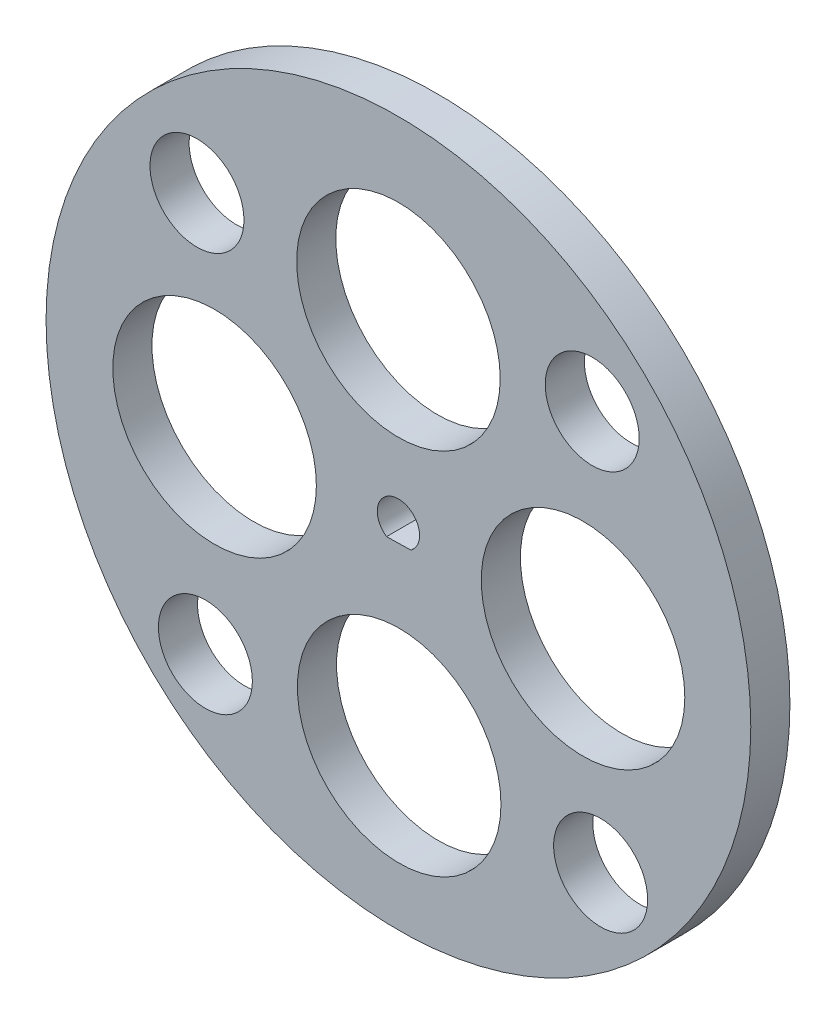
ISO-10303-21;
HEADER;
FILE_DESCRIPTION(('STEP AP214'),'2;1');
FILE_NAME('part.step','',(''),(''),'','','');
FILE_SCHEMA(('AUTOMOTIVE_DESIGN { 1 0 10303 214 1 1 1 1 }'));
ENDSEC;
DATA;
#1=APPLICATION_CONTEXT('core data for automotive mechanical design processes');
#2=APPLICATION_PROTOCOL_DEFINITION('international standard','automotive_design',2000,#1);
#3=PRODUCT_CONTEXT('',#1,'mechanical');
#4=PRODUCT('Part','Part','',(#3));
#5=PRODUCT_RELATED_PRODUCT_CATEGORY('part','',(#4));
#6=PRODUCT_DEFINITION_FORMATION('','',#4);
#7=PRODUCT_DEFINITION_CONTEXT('part definition',#1,'design');
#8=PRODUCT_DEFINITION('design','',#6,#7);
#9=PRODUCT_DEFINITION_SHAPE('','',#8);
#10=(LENGTH_UNIT() NAMED_UNIT(*) SI_UNIT(.MILLI.,.METRE.));
#11=(NAMED_UNIT(*) PLANE_ANGLE_UNIT() SI_UNIT($,.RADIAN.));
#12=(NAMED_UNIT(*) SI_UNIT($,.STERADIAN.) SOLID_ANGLE_UNIT());
#13=UNCERTAINTY_MEASURE_WITH_UNIT(LENGTH_MEASURE(1.E-05),#10,'distance_accuracy_value','');
#14=(GEOMETRIC_REPRESENTATION_CONTEXT(3) GLOBAL_UNCERTAINTY_ASSIGNED_CONTEXT((#13)) GLOBAL_UNIT_ASSIGNED_CONTEXT((#10,
#11,#12)) REPRESENTATION_CONTEXT('',''));
#15=CARTESIAN_POINT('',(0.,0.,0.));
#16=DIRECTION('',(0.,0.,1.));
#17=DIRECTION('',(1.,0.,0.));
#18=AXIS2_PLACEMENT_3D('',#15,#16,#17);
#19=CARTESIAN_POINT('',(-0.0477356811711086,1.02658753548092,5.));
#20=DIRECTION('',(0.,0.,1.));
#21=DIRECTION('',(1.,0.,0.));
#22=AXIS2_PLACEMENT_3D('',#19,#20,#21);
#23=PLANE('',#22);
#24=CARTESIAN_POINT('',(-24.7010016603567,-25.7753248770113,5.));
#25=DIRECTION('',(0.,0.,1.));
#26=DIRECTION('',(1.,0.,0.));
#27=AXIS2_PLACEMENT_3D('',#24,#25,#26);
#28=CIRCLE('',#27,6.00000000000113);
#29=CARTESIAN_POINT('',(-18.7010016603556,-25.7753248770113,5.));
#30=VERTEX_POINT('',#29);
#31=EDGE_CURVE('E113',#30,#30,#28,.T.);
#32=ORIENTED_EDGE('',*,*,#31,.F.);
#33=EDGE_LOOP('',(#32));
#34=FACE_BOUND('',#33,.T.);
#35=CARTESIAN_POINT('',(-23.5265875354803,-0.0477356811717486,5.));
#36=DIRECTION('',(0.,0.,1.));
#37=DIRECTION('',(1.,0.,0.));
#38=AXIS2_PLACEMENT_3D('',#35,#36,#37);
#39=CIRCLE('',#38,13.);
#40=CARTESIAN_POINT('',(-10.5265875354803,-0.0477356811717486,5.));
#41=VERTEX_POINT('',#40);
#42=EDGE_CURVE('E101',#41,#41,#39,.T.);
#43=ORIENTED_EDGE('',*,*,#42,.F.);
#44=EDGE_LOOP('',(#43));
#45=FACE_BOUND('',#44,.T.);
#46=CARTESIAN_POINT('',(23.5265875354816,0.0477356811717458,5.));
#47=DIRECTION('',(0.,0.,1.));
#48=DIRECTION('',(1.,0.,0.));
#49=AXIS2_PLACEMENT_3D('',#46,#47,#48);
#50=CIRCLE('',#49,13.);
#51=CARTESIAN_POINT('',(36.5265875354815,0.0477356811717458,5.));
#52=VERTEX_POINT('',#51);
#53=EDGE_CURVE('E89',#52,#52,#50,.T.);
#54=ORIENTED_EDGE('',*,*,#53,.F.);
#55=EDGE_LOOP('',(#54));
#56=FACE_BOUND('',#55,.T.);
#57=CARTESIAN_POINT('',(-0.047735681171109,23.5265875354809,5.));
#58=DIRECTION('',(0.,0.,1.));
#59=DIRECTION('',(1.,0.,0.));
#60=AXIS2_PLACEMENT_3D('',#57,#58,#59);
#61=CIRCLE('',#60,13.);
#62=CARTESIAN_POINT('',(12.9522643188289,23.5265875354809,5.));
#63=VERTEX_POINT('',#62);
#64=EDGE_CURVE('E73',#63,#63,#61,.T.);
#65=ORIENTED_EDGE('',*,*,#64,.F.);
#66=EDGE_LOOP('',(#65));
#67=FACE_BOUND('',#66,.T.);
#68=CARTESIAN_POINT('',(-0.0477356811711086,1.02658753548092,5.));
#69=DIRECTION('',(0.,0.,1.));
#70=DIRECTION('',(1.,0.,0.));
#71=AXIS2_PLACEMENT_3D('',#68,#69,#70);
#72=CIRCLE('',#71,45.);
#73=CARTESIAN_POINT('',(44.9522643188289,1.02658753548092,5.));
#74=VERTEX_POINT('',#73);
#75=EDGE_CURVE('E11',#74,#74,#72,.T.);
#76=ORIENTED_EDGE('',*,*,#75,.T.);
#77=EDGE_LOOP('',(#76));
#78=FACE_BOUND('',#77,.T.);
#79=DIRECTION('',(0.999777310071625,0.0211028497114699,0.));
#80=VECTOR('',#79,1.);
#81=CARTESIAN_POINT('',(-1.56595718523754,-1.20612459656617,5.));
#82=LINE('',#81,#80);
#83=CARTESIAN_POINT('',(-1.56595718523754,-1.20612459656617,5.));
#84=VERTEX_POINT('',#83);
#85=CARTESIAN_POINT('',(1.56334579528665,-1.14007267696927,5.));
#86=VERTEX_POINT('',#85);
#87=EDGE_CURVE('E79',#84,#86,#82,.T.);
#88=ORIENTED_EDGE('',*,*,#87,.F.);
#89=CARTESIAN_POINT('',(-0.0477356811711086,1.02658753548092,5.));
#90=DIRECTION('',(0.,0.,1.));
#91=DIRECTION('',(1.,0.,0.));
#92=AXIS2_PLACEMENT_3D('',#89,#90,#91);
#93=CIRCLE('',#92,2.7);
#94=EDGE_CURVE('E65',#86,#84,#93,.T.);
#95=ORIENTED_EDGE('',*,*,#94,.F.);
#96=EDGE_LOOP('',(#88,#95));
#97=FACE_BOUND('',#96,.T.);
#98=CARTESIAN_POINT('',(24.7010016603582,25.77532487701,5.));
#99=DIRECTION('',(0.,0.,1.));
#100=DIRECTION('',(1.,0.,0.));
#101=AXIS2_PLACEMENT_3D('',#98,#99,#100);
#102=CIRCLE('',#101,6.00000000000113);
#103=CARTESIAN_POINT('',(30.7010016603593,25.77532487701,5.));
#104=VERTEX_POINT('',#103);
#105=EDGE_CURVE('E84',#104,#104,#102,.T.);
#106=ORIENTED_EDGE('',*,*,#105,.F.);
#107=EDGE_LOOP('',(#106));
#108=FACE_BOUND('',#107,.T.);
#109=CARTESIAN_POINT('',(0.0477356811723826,-23.5265875354809,5.));
#110=DIRECTION('',(0.,0.,1.));
#111=DIRECTION('',(1.,0.,0.));
#112=AXIS2_PLACEMENT_3D('',#109,#110,#111);
#113=CIRCLE('',#112,13.);
#114=CARTESIAN_POINT('',(13.0477356811724,-23.5265875354809,5.));
#115=VERTEX_POINT('',#114);
#116=EDGE_CURVE('E95',#115,#115,#113,.T.);
#117=ORIENTED_EDGE('',*,*,#116,.F.);
#118=EDGE_LOOP('',(#117));
#119=FACE_BOUND('',#118,.T.);
#120=CARTESIAN_POINT('',(25.7753248770113,-24.7010016603581,5.));
#121=DIRECTION('',(0.,0.,1.));
#122=DIRECTION('',(1.,0.,0.));
#123=AXIS2_PLACEMENT_3D('',#120,#121,#122);
#124=CIRCLE('',#123,6.00000000000113);
#125=CARTESIAN_POINT('',(31.7753248770125,-24.7010016603581,5.));
#126=VERTEX_POINT('',#125);
#127=EDGE_CURVE('E107',#126,#126,#124,.T.);
#128=ORIENTED_EDGE('',*,*,#127,.F.);
#129=EDGE_LOOP('',(#128));
#130=FACE_BOUND('',#129,.T.);
#131=CARTESIAN_POINT('',(-25.7753248770099,24.7010016603568,5.));
#132=DIRECTION('',(0.,0.,1.));
#133=DIRECTION('',(1.,0.,0.));
#134=AXIS2_PLACEMENT_3D('',#131,#132,#133);
#135=CIRCLE('',#134,6.00000000000113);
#136=CARTESIAN_POINT('',(-19.7753248770087,24.7010016603568,5.));
#137=VERTEX_POINT('',#136);
#138=EDGE_CURVE('E119',#137,#137,#135,.T.);
#139=ORIENTED_EDGE('',*,*,#138,.F.);
#140=EDGE_LOOP('',(#139));
#141=FACE_BOUND('',#140,.T.);
#142=ADVANCED_FACE('F33',(#34,#45,#56,#67,#78,#97,#108,#119,#130,#141),#23,.T.);
#143=CARTESIAN_POINT('',(-0.0477356811711086,1.02658753548092,0.));
#144=DIRECTION('',(0.,0.,1.));
#145=DIRECTION('',(1.,0.,0.));
#146=AXIS2_PLACEMENT_3D('',#143,#144,#145);
#147=PLANE('',#146);
#148=CARTESIAN_POINT('',(-0.0477356811711086,1.02658753548092,0.));
#149=DIRECTION('',(0.,0.,1.));
#150=DIRECTION('',(1.,0.,0.));
#151=AXIS2_PLACEMENT_3D('',#148,#149,#150);
#152=CIRCLE('',#151,45.);
#153=CARTESIAN_POINT('',(44.9522643188289,1.02658753548092,0.));
#154=VERTEX_POINT('',#153);
#155=EDGE_CURVE('E37',#154,#154,#152,.T.);
#156=ORIENTED_EDGE('',*,*,#155,.F.);
#157=EDGE_LOOP('',(#156));
#158=FACE_BOUND('',#157,.T.);
#159=CARTESIAN_POINT('',(-0.0477356811711086,1.02658753548092,0.));
#160=DIRECTION('',(0.,0.,1.));
#161=DIRECTION('',(1.,0.,0.));
#162=AXIS2_PLACEMENT_3D('',#159,#160,#161);
#163=CIRCLE('',#162,2.7);
#164=CARTESIAN_POINT('',(1.56334579528665,-1.14007267696927,0.));
#165=VERTEX_POINT('',#164);
#166=CARTESIAN_POINT('',(-1.56595718523754,-1.20612459656617,0.));
#167=VERTEX_POINT('',#166);
#168=EDGE_CURVE('E55',#165,#167,#163,.T.);
#169=ORIENTED_EDGE('',*,*,#168,.T.);
#170=DIRECTION('',(0.999777310071625,0.0211028497114699,0.));
#171=VECTOR('',#170,1.);
#172=CARTESIAN_POINT('',(-1.56595718523754,-1.20612459656617,0.));
#173=LINE('',#172,#171);
#174=EDGE_CURVE('E61',#167,#165,#173,.T.);
#175=ORIENTED_EDGE('',*,*,#174,.T.);
#176=EDGE_LOOP('',(#169,#175));
#177=FACE_BOUND('',#176,.T.);
#178=CARTESIAN_POINT('',(-0.047735681171109,23.5265875354809,0.));
#179=DIRECTION('',(0.,0.,1.));
#180=DIRECTION('',(1.,0.,0.));
#181=AXIS2_PLACEMENT_3D('',#178,#179,#180);
#182=CIRCLE('',#181,13.);
#183=CARTESIAN_POINT('',(12.9522643188289,23.5265875354809,0.));
#184=VERTEX_POINT('',#183);
#185=EDGE_CURVE('E76',#184,#184,#182,.T.);
#186=ORIENTED_EDGE('',*,*,#185,.T.);
#187=EDGE_LOOP('',(#186));
#188=FACE_BOUND('',#187,.T.);
#189=CARTESIAN_POINT('',(24.7010016603582,25.77532487701,0.));
#190=DIRECTION('',(0.,0.,1.));
#191=DIRECTION('',(1.,0.,0.));
#192=AXIS2_PLACEMENT_3D('',#189,#190,#191);
#193=CIRCLE('',#192,6.00000000000113);
#194=CARTESIAN_POINT('',(30.7010016603593,25.77532487701,0.));
#195=VERTEX_POINT('',#194);
#196=EDGE_CURVE('E86',#195,#195,#193,.T.);
#197=ORIENTED_EDGE('',*,*,#196,.T.);
#198=EDGE_LOOP('',(#197));
#199=FACE_BOUND('',#198,.T.);
#200=CARTESIAN_POINT('',(23.5265875354816,0.0477356811717458,0.));
#201=DIRECTION('',(0.,0.,1.));
#202=DIRECTION('',(1.,0.,0.));
#203=AXIS2_PLACEMENT_3D('',#200,#201,#202);
#204=CIRCLE('',#203,13.);
#205=CARTESIAN_POINT('',(36.5265875354815,0.0477356811717458,0.));
#206=VERTEX_POINT('',#205);
#207=EDGE_CURVE('E92',#206,#206,#204,.T.);
#208=ORIENTED_EDGE('',*,*,#207,.T.);
#209=EDGE_LOOP('',(#208));
#210=FACE_BOUND('',#209,.T.);
#211=CARTESIAN_POINT('',(0.0477356811723826,-23.5265875354809,0.));
#212=DIRECTION('',(0.,0.,1.));
#213=DIRECTION('',(1.,0.,0.));
#214=AXIS2_PLACEMENT_3D('',#211,#212,#213);
#215=CIRCLE('',#214,13.);
#216=CARTESIAN_POINT('',(13.0477356811724,-23.5265875354809,0.));
#217=VERTEX_POINT('',#216);
#218=EDGE_CURVE('E98',#217,#217,#215,.T.);
#219=ORIENTED_EDGE('',*,*,#218,.T.);
#220=EDGE_LOOP('',(#219));
#221=FACE_BOUND('',#220,.T.);
#222=CARTESIAN_POINT('',(-23.5265875354803,-0.0477356811717486,0.));
#223=DIRECTION('',(0.,0.,1.));
#224=DIRECTION('',(1.,0.,0.));
#225=AXIS2_PLACEMENT_3D('',#222,#223,#224);
#226=CIRCLE('',#225,13.);
#227=CARTESIAN_POINT('',(-10.5265875354803,-0.0477356811717486,0.));
#228=VERTEX_POINT('',#227);
#229=EDGE_CURVE('E104',#228,#228,#226,.T.);
#230=ORIENTED_EDGE('',*,*,#229,.T.);
#231=EDGE_LOOP('',(#230));
#232=FACE_BOUND('',#231,.T.);
#233=CARTESIAN_POINT('',(25.7753248770113,-24.7010016603581,0.));
#234=DIRECTION('',(0.,0.,1.));
#235=DIRECTION('',(1.,0.,0.));
#236=AXIS2_PLACEMENT_3D('',#233,#234,#235);
#237=CIRCLE('',#236,6.00000000000113);
#238=CARTESIAN_POINT('',(31.7753248770125,-24.7010016603581,0.));
#239=VERTEX_POINT('',#238);
#240=EDGE_CURVE('E110',#239,#239,#237,.T.);
#241=ORIENTED_EDGE('',*,*,#240,.T.);
#242=EDGE_LOOP('',(#241));
#243=FACE_BOUND('',#242,.T.);
#244=CARTESIAN_POINT('',(-24.7010016603567,-25.7753248770113,0.));
#245=DIRECTION('',(0.,0.,1.));
#246=DIRECTION('',(1.,0.,0.));
#247=AXIS2_PLACEMENT_3D('',#244,#245,#246);
#248=CIRCLE('',#247,6.00000000000113);
#249=CARTESIAN_POINT('',(-18.7010016603556,-25.7753248770113,0.));
#250=VERTEX_POINT('',#249);
#251=EDGE_CURVE('E116',#250,#250,#248,.T.);
#252=ORIENTED_EDGE('',*,*,#251,.T.);
#253=EDGE_LOOP('',(#252));
#254=FACE_BOUND('',#253,.T.);
#255=CARTESIAN_POINT('',(-25.7753248770099,24.7010016603568,0.));
#256=DIRECTION('',(0.,0.,1.));
#257=DIRECTION('',(1.,0.,0.));
#258=AXIS2_PLACEMENT_3D('',#255,#256,#257);
#259=CIRCLE('',#258,6.00000000000113);
#260=CARTESIAN_POINT('',(-19.7753248770087,24.7010016603568,0.));
#261=VERTEX_POINT('',#260);
#262=EDGE_CURVE('E122',#261,#261,#259,.T.);
#263=ORIENTED_EDGE('',*,*,#262,.T.);
#264=EDGE_LOOP('',(#263));
#265=FACE_BOUND('',#264,.T.);
#266=ADVANCED_FACE('F71',(#158,#177,#188,#199,#210,#221,#232,#243,#254,#265),#147,.F.);
#267=CARTESIAN_POINT('',(-0.0477356811711086,1.02658753548092,5.));
#268=DIRECTION('',(0.,0.,-1.));
#269=DIRECTION('',(-1.,0.,0.));
#270=AXIS2_PLACEMENT_3D('',#267,#268,#269);
#271=CYLINDRICAL_SURFACE('',#270,45.);
#272=ORIENTED_EDGE('',*,*,#75,.F.);
#273=EDGE_LOOP('',(#272));
#274=FACE_BOUND('',#273,.T.);
#275=ORIENTED_EDGE('',*,*,#155,.T.);
#276=EDGE_LOOP('',(#275));
#277=FACE_BOUND('',#276,.T.);
#278=ADVANCED_FACE('F35',(#274,#277),#271,.T.);
#279=CARTESIAN_POINT('',(-0.0477356811711086,1.02658753548092,5.));
#280=DIRECTION('',(0.,0.,-1.));
#281=DIRECTION('',(-1.,0.,0.));
#282=AXIS2_PLACEMENT_3D('',#279,#280,#281);
#283=CYLINDRICAL_SURFACE('',#282,2.7);
#284=ORIENTED_EDGE('',*,*,#168,.F.);
#285=DIRECTION('',(0.,0.,-1.));
#286=VECTOR('',#285,1.);
#287=CARTESIAN_POINT('',(1.56334579528665,-1.14007267696927,5.));
#288=LINE('',#287,#286);
#289=EDGE_CURVE('E63',#86,#165,#288,.T.);
#290=ORIENTED_EDGE('',*,*,#289,.F.);
#291=ORIENTED_EDGE('',*,*,#94,.T.);
#292=DIRECTION('',(0.,0.,-1.));
#293=VECTOR('',#292,1.);
#294=CARTESIAN_POINT('',(-1.56595718523754,-1.20612459656617,5.));
#295=LINE('',#294,#293);
#296=EDGE_CURVE('E48',#84,#167,#295,.T.);
#297=ORIENTED_EDGE('',*,*,#296,.T.);
#298=EDGE_LOOP('',(#284,#290,#291,#297));
#299=FACE_BOUND('',#298,.T.);
#300=ADVANCED_FACE('F67',(#299),#283,.F.);
#301=CARTESIAN_POINT('',(-1.56595718523754,-1.20612459656617,5.));
#302=DIRECTION('',(-0.0211028497114699,0.999777310071625,0.));
#303=DIRECTION('',(-0.999777310071626,-0.0211028497114699,0.));
#304=AXIS2_PLACEMENT_3D('',#301,#302,#303);
#305=PLANE('',#304);
#306=ORIENTED_EDGE('',*,*,#174,.F.);
#307=ORIENTED_EDGE('',*,*,#296,.F.);
#308=ORIENTED_EDGE('',*,*,#87,.T.);
#309=ORIENTED_EDGE('',*,*,#289,.T.);
#310=EDGE_LOOP('',(#306,#307,#308,#309));
#311=FACE_BOUND('',#310,.T.);
#312=ADVANCED_FACE('F62',(#311),#305,.T.);
#313=CARTESIAN_POINT('',(-0.047735681171109,23.5265875354809,5.));
#314=DIRECTION('',(0.,0.,-1.));
#315=DIRECTION('',(-1.,0.,0.));
#316=AXIS2_PLACEMENT_3D('',#313,#314,#315);
#317=CYLINDRICAL_SURFACE('',#316,13.);
#318=ORIENTED_EDGE('',*,*,#64,.T.);
#319=EDGE_LOOP('',(#318));
#320=FACE_BOUND('',#319,.T.);
#321=ORIENTED_EDGE('',*,*,#185,.F.);
#322=EDGE_LOOP('',(#321));
#323=FACE_BOUND('',#322,.T.);
#324=ADVANCED_FACE('F145',(#320,#323),#317,.F.);
#325=CARTESIAN_POINT('',(24.7010016603582,25.77532487701,5.));
#326=DIRECTION('',(0.,0.,-1.));
#327=DIRECTION('',(-1.,0.,0.));
#328=AXIS2_PLACEMENT_3D('',#325,#326,#327);
#329=CYLINDRICAL_SURFACE('',#328,6.00000000000113);
#330=ORIENTED_EDGE('',*,*,#105,.T.);
#331=EDGE_LOOP('',(#330));
#332=FACE_BOUND('',#331,.T.);
#333=ORIENTED_EDGE('',*,*,#196,.F.);
#334=EDGE_LOOP('',(#333));
#335=FACE_BOUND('',#334,.T.);
#336=ADVANCED_FACE('F148',(#332,#335),#329,.F.);
#337=CARTESIAN_POINT('',(23.5265875354816,0.0477356811717458,5.));
#338=DIRECTION('',(0.,0.,-1.));
#339=DIRECTION('',(-1.,0.,0.));
#340=AXIS2_PLACEMENT_3D('',#337,#338,#339);
#341=CYLINDRICAL_SURFACE('',#340,13.);
#342=ORIENTED_EDGE('',*,*,#53,.T.);
#343=EDGE_LOOP('',(#342));
#344=FACE_BOUND('',#343,.T.);
#345=ORIENTED_EDGE('',*,*,#207,.F.);
#346=EDGE_LOOP('',(#345));
#347=FACE_BOUND('',#346,.T.);
#348=ADVANCED_FACE('F152',(#344,#347),#341,.F.);
#349=CARTESIAN_POINT('',(0.0477356811723826,-23.5265875354809,5.));
#350=DIRECTION('',(0.,0.,-1.));
#351=DIRECTION('',(-1.,0.,0.));
#352=AXIS2_PLACEMENT_3D('',#349,#350,#351);
#353=CYLINDRICAL_SURFACE('',#352,13.);
#354=ORIENTED_EDGE('',*,*,#116,.T.);
#355=EDGE_LOOP('',(#354));
#356=FACE_BOUND('',#355,.T.);
#357=ORIENTED_EDGE('',*,*,#218,.F.);
#358=EDGE_LOOP('',(#357));
#359=FACE_BOUND('',#358,.T.);
#360=ADVANCED_FACE('F156',(#356,#359),#353,.F.);
#361=CARTESIAN_POINT('',(-23.5265875354803,-0.0477356811717486,5.));
#362=DIRECTION('',(0.,0.,-1.));
#363=DIRECTION('',(-1.,0.,0.));
#364=AXIS2_PLACEMENT_3D('',#361,#362,#363);
#365=CYLINDRICAL_SURFACE('',#364,13.);
#366=ORIENTED_EDGE('',*,*,#42,.T.);
#367=EDGE_LOOP('',(#366));
#368=FACE_BOUND('',#367,.T.);
#369=ORIENTED_EDGE('',*,*,#229,.F.);
#370=EDGE_LOOP('',(#369));
#371=FACE_BOUND('',#370,.T.);
#372=ADVANCED_FACE('F160',(#368,#371),#365,.F.);
#373=CARTESIAN_POINT('',(25.7753248770113,-24.7010016603581,5.));
#374=DIRECTION('',(0.,0.,-1.));
#375=DIRECTION('',(-1.,0.,0.));
#376=AXIS2_PLACEMENT_3D('',#373,#374,#375);
#377=CYLINDRICAL_SURFACE('',#376,6.00000000000113);
#378=ORIENTED_EDGE('',*,*,#127,.T.);
#379=EDGE_LOOP('',(#378));
#380=FACE_BOUND('',#379,.T.);
#381=ORIENTED_EDGE('',*,*,#240,.F.);
#382=EDGE_LOOP('',(#381));
#383=FACE_BOUND('',#382,.T.);
#384=ADVANCED_FACE('F164',(#380,#383),#377,.F.);
#385=CARTESIAN_POINT('',(-24.7010016603567,-25.7753248770113,5.));
#386=DIRECTION('',(0.,0.,-1.));
#387=DIRECTION('',(-1.,0.,0.));
#388=AXIS2_PLACEMENT_3D('',#385,#386,#387);
#389=CYLINDRICAL_SURFACE('',#388,6.00000000000113);
#390=ORIENTED_EDGE('',*,*,#31,.T.);
#391=EDGE_LOOP('',(#390));
#392=FACE_BOUND('',#391,.T.);
#393=ORIENTED_EDGE('',*,*,#251,.F.);
#394=EDGE_LOOP('',(#393));
#395=FACE_BOUND('',#394,.T.);
#396=ADVANCED_FACE('F168',(#392,#395),#389,.F.);
#397=CARTESIAN_POINT('',(-25.7753248770099,24.7010016603568,5.));
#398=DIRECTION('',(0.,0.,-1.));
#399=DIRECTION('',(-1.,0.,0.));
#400=AXIS2_PLACEMENT_3D('',#397,#398,#399);
#401=CYLINDRICAL_SURFACE('',#400,6.00000000000113);
#402=ORIENTED_EDGE('',*,*,#138,.T.);
#403=EDGE_LOOP('',(#402));
#404=FACE_BOUND('',#403,.T.);
#405=ORIENTED_EDGE('',*,*,#262,.F.);
#406=EDGE_LOOP('',(#405));
#407=FACE_BOUND('',#406,.T.);
#408=ADVANCED_FACE('F128',(#404,#407),#401,.F.);
#409=CLOSED_SHELL('',(#142,#266,#278,#300,#312,#324,#336,#348,#360,#372,#384,#396,#408));
#410=MANIFOLD_SOLID_BREP('B2',#409);
#411=ADVANCED_BREP_SHAPE_REPRESENTATION('',(#18,#410),#14);
#412=SHAPE_DEFINITION_REPRESENTATION(#9,#411);
ENDSEC;
END-ISO-10303-21;
